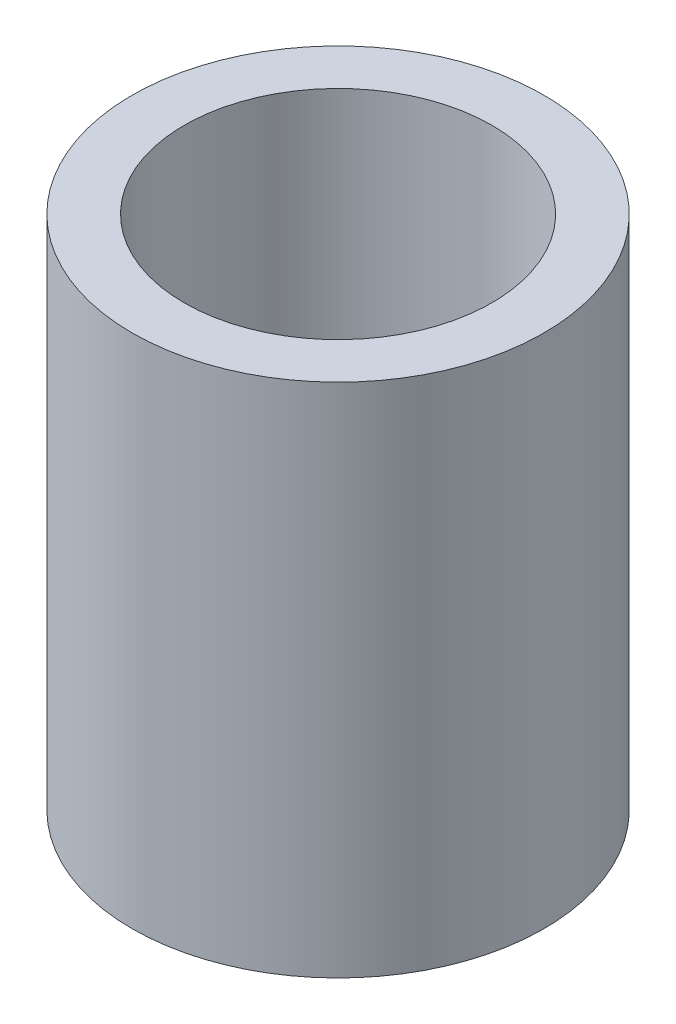
ISO-10303-21;
HEADER;
FILE_DESCRIPTION(('STEP AP214'),'2;1');
FILE_NAME('part.step','',(''),(''),'','','');
FILE_SCHEMA(('AUTOMOTIVE_DESIGN { 1 0 10303 214 1 1 1 1 }'));
ENDSEC;
DATA;
#1=APPLICATION_CONTEXT('core data for automotive mechanical design processes');
#2=APPLICATION_PROTOCOL_DEFINITION('international standard','automotive_design',2000,#1);
#3=PRODUCT_CONTEXT('',#1,'mechanical');
#4=PRODUCT('Part','Part','',(#3));
#5=PRODUCT_RELATED_PRODUCT_CATEGORY('part','',(#4));
#6=PRODUCT_DEFINITION_FORMATION('','',#4);
#7=PRODUCT_DEFINITION_CONTEXT('part definition',#1,'design');
#8=PRODUCT_DEFINITION('design','',#6,#7);
#9=PRODUCT_DEFINITION_SHAPE('','',#8);
#10=(LENGTH_UNIT() NAMED_UNIT(*) SI_UNIT(.MILLI.,.METRE.));
#11=(NAMED_UNIT(*) PLANE_ANGLE_UNIT() SI_UNIT($,.RADIAN.));
#12=(NAMED_UNIT(*) SI_UNIT($,.STERADIAN.) SOLID_ANGLE_UNIT());
#13=UNCERTAINTY_MEASURE_WITH_UNIT(LENGTH_MEASURE(1.E-05),#10,'distance_accuracy_value','');
#14=(GEOMETRIC_REPRESENTATION_CONTEXT(3) GLOBAL_UNCERTAINTY_ASSIGNED_CONTEXT((#13)) GLOBAL_UNIT_ASSIGNED_CONTEXT((#10,
#11,#12)) REPRESENTATION_CONTEXT('',''));
#15=CARTESIAN_POINT('',(0.,0.,0.));
#16=DIRECTION('',(0.,0.,1.));
#17=DIRECTION('',(1.,0.,0.));
#18=AXIS2_PLACEMENT_3D('',#15,#16,#17);
#19=CARTESIAN_POINT('',(0.,37.5882512171281,0.));
#20=DIRECTION('',(0.,-1.,0.));
#21=DIRECTION('',(0.,0.,-1.));
#22=AXIS2_PLACEMENT_3D('',#19,#20,#21);
#23=CYLINDRICAL_SURFACE('',#22,15.);
#24=CARTESIAN_POINT('',(0.,37.5882512171281,0.));
#25=DIRECTION('',(0.,1.,0.));
#26=DIRECTION('',(0.,0.,1.));
#27=AXIS2_PLACEMENT_3D('',#24,#25,#26);
#28=CIRCLE('',#27,15.);
#29=CARTESIAN_POINT('',(0.,37.5882512171281,15.));
#30=VERTEX_POINT('',#29);
#31=EDGE_CURVE('E10',#30,#30,#28,.T.);
#32=ORIENTED_EDGE('',*,*,#31,.F.);
#33=EDGE_LOOP('',(#32));
#34=FACE_BOUND('',#33,.T.);
#35=CARTESIAN_POINT('',(0.,0.,0.));
#36=DIRECTION('',(0.,1.,0.));
#37=DIRECTION('',(0.,0.,1.));
#38=AXIS2_PLACEMENT_3D('',#35,#36,#37);
#39=CIRCLE('',#38,15.);
#40=CARTESIAN_POINT('',(0.,0.,15.));
#41=VERTEX_POINT('',#40);
#42=EDGE_CURVE('E37',#41,#41,#39,.T.);
#43=ORIENTED_EDGE('',*,*,#42,.T.);
#44=EDGE_LOOP('',(#43));
#45=FACE_BOUND('',#44,.T.);
#46=ADVANCED_FACE('F40',(#34,#45),#23,.T.);
#47=CARTESIAN_POINT('',(0.,37.5882512171281,0.));
#48=DIRECTION('',(0.,1.,0.));
#49=DIRECTION('',(0.,0.,1.));
#50=AXIS2_PLACEMENT_3D('',#47,#48,#49);
#51=PLANE('',#50);
#52=CARTESIAN_POINT('',(0.,37.5882512171281,0.));
#53=DIRECTION('',(0.,1.,0.));
#54=DIRECTION('',(0.,0.,1.));
#55=AXIS2_PLACEMENT_3D('',#52,#53,#54);
#56=CIRCLE('',#55,11.2069677384904);
#57=CARTESIAN_POINT('',(0.,37.5882512171281,11.2069677384904));
#58=VERTEX_POINT('',#57);
#59=EDGE_CURVE('E50',#58,#58,#56,.T.);
#60=ORIENTED_EDGE('',*,*,#59,.F.);
#61=EDGE_LOOP('',(#60));
#62=FACE_BOUND('',#61,.T.);
#63=ORIENTED_EDGE('',*,*,#31,.T.);
#64=EDGE_LOOP('',(#63));
#65=FACE_BOUND('',#64,.T.);
#66=ADVANCED_FACE('F59',(#62,#65),#51,.T.);
#67=CARTESIAN_POINT('',(0.,0.,0.));
#68=DIRECTION('',(0.,1.,0.));
#69=DIRECTION('',(0.,0.,1.));
#70=AXIS2_PLACEMENT_3D('',#67,#68,#69);
#71=PLANE('',#70);
#72=CARTESIAN_POINT('',(0.,0.,0.));
#73=DIRECTION('',(0.,1.,0.));
#74=DIRECTION('',(0.,0.,1.));
#75=AXIS2_PLACEMENT_3D('',#72,#73,#74);
#76=CIRCLE('',#75,11.2069677384904);
#77=CARTESIAN_POINT('',(0.,0.,11.2069677384904));
#78=VERTEX_POINT('',#77);
#79=EDGE_CURVE('E47',#78,#78,#76,.T.);
#80=ORIENTED_EDGE('',*,*,#79,.T.);
#81=EDGE_LOOP('',(#80));
#82=FACE_BOUND('',#81,.T.);
#83=ORIENTED_EDGE('',*,*,#42,.F.);
#84=EDGE_LOOP('',(#83));
#85=FACE_BOUND('',#84,.T.);
#86=ADVANCED_FACE('F58',(#82,#85),#71,.F.);
#87=CARTESIAN_POINT('',(0.,37.5882512171281,0.));
#88=DIRECTION('',(0.,-1.,0.));
#89=DIRECTION('',(0.,0.,-1.));
#90=AXIS2_PLACEMENT_3D('',#87,#88,#89);
#91=CYLINDRICAL_SURFACE('',#90,11.2069677384904);
#92=ORIENTED_EDGE('',*,*,#59,.T.);
#93=EDGE_LOOP('',(#92));
#94=FACE_BOUND('',#93,.T.);
#95=ORIENTED_EDGE('',*,*,#79,.F.);
#96=EDGE_LOOP('',(#95));
#97=FACE_BOUND('',#96,.T.);
#98=ADVANCED_FACE('F54',(#94,#97),#91,.F.);
#99=CLOSED_SHELL('',(#46,#66,#86,#98));
#100=MANIFOLD_SOLID_BREP('B2',#99);
#101=ADVANCED_BREP_SHAPE_REPRESENTATION('',(#18,#100),#14);
#102=SHAPE_DEFINITION_REPRESENTATION(#9,#101);
ENDSEC;
END-ISO-10303-21;
